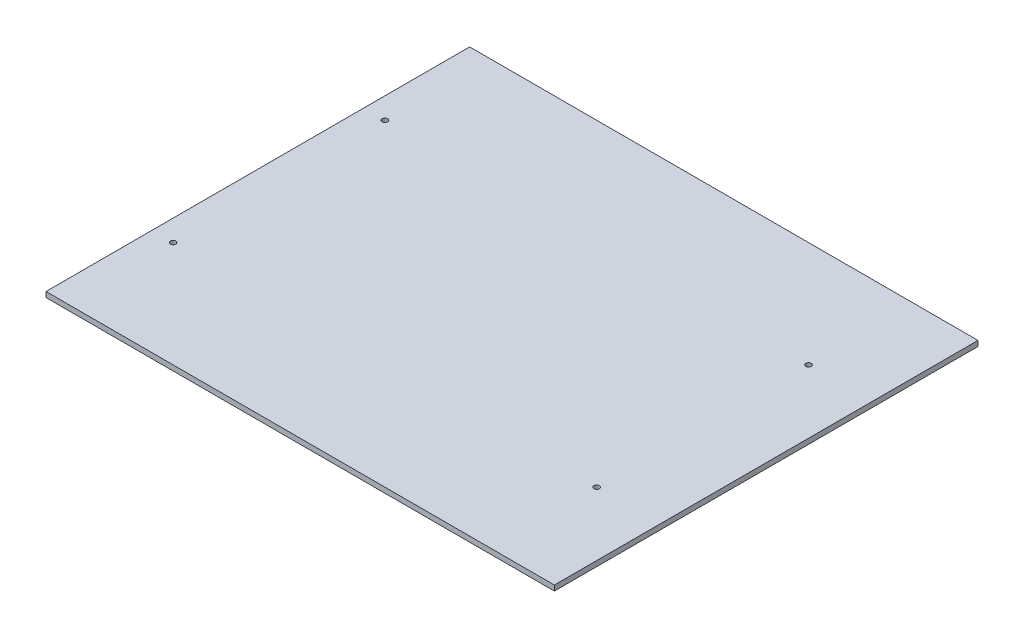
ISO-10303-21;
HEADER;
FILE_DESCRIPTION(('STEP AP214'),'2;1');
FILE_NAME('part.step','',(''),(''),'','','');
FILE_SCHEMA(('AUTOMOTIVE_DESIGN { 1 0 10303 214 1 1 1 1 }'));
ENDSEC;
DATA;
#1=APPLICATION_CONTEXT('core data for automotive mechanical design processes');
#2=APPLICATION_PROTOCOL_DEFINITION('international standard','automotive_design',2000,#1);
#3=PRODUCT_CONTEXT('',#1,'mechanical');
#4=PRODUCT('Part','Part','',(#3));
#5=PRODUCT_RELATED_PRODUCT_CATEGORY('part','',(#4));
#6=PRODUCT_DEFINITION_FORMATION('','',#4);
#7=PRODUCT_DEFINITION_CONTEXT('part definition',#1,'design');
#8=PRODUCT_DEFINITION('design','',#6,#7);
#9=PRODUCT_DEFINITION_SHAPE('','',#8);
#10=(LENGTH_UNIT() NAMED_UNIT(*) SI_UNIT(.MILLI.,.METRE.));
#11=(NAMED_UNIT(*) PLANE_ANGLE_UNIT() SI_UNIT($,.RADIAN.));
#12=(NAMED_UNIT(*) SI_UNIT($,.STERADIAN.) SOLID_ANGLE_UNIT());
#13=UNCERTAINTY_MEASURE_WITH_UNIT(LENGTH_MEASURE(1.E-05),#10,'distance_accuracy_value','');
#14=(GEOMETRIC_REPRESENTATION_CONTEXT(3) GLOBAL_UNCERTAINTY_ASSIGNED_CONTEXT((#13)) GLOBAL_UNIT_ASSIGNED_CONTEXT((#10,
#11,#12)) REPRESENTATION_CONTEXT('',''));
#15=CARTESIAN_POINT('',(0.,0.,0.));
#16=DIRECTION('',(0.,0.,1.));
#17=DIRECTION('',(1.,0.,0.));
#18=AXIS2_PLACEMENT_3D('',#15,#16,#17);
#19=CARTESIAN_POINT('',(0.,6.35,0.));
#20=DIRECTION('',(-1.,0.,0.));
#21=DIRECTION('',(0.,0.,1.));
#22=AXIS2_PLACEMENT_3D('',#19,#20,#21);
#23=PLANE('',#22);
#24=DIRECTION('',(0.,0.,-1.));
#25=VECTOR('',#24,1.);
#26=CARTESIAN_POINT('',(0.,0.,0.));
#27=LINE('',#26,#25);
#28=CARTESIAN_POINT('',(0.,0.,0.));
#29=VERTEX_POINT('',#28);
#30=CARTESIAN_POINT('',(0.,0.,-508.));
#31=VERTEX_POINT('',#30);
#32=EDGE_CURVE('E114',#29,#31,#27,.T.);
#33=ORIENTED_EDGE('',*,*,#32,.T.);
#34=DIRECTION('',(0.,-1.,0.));
#35=VECTOR('',#34,1.);
#36=CARTESIAN_POINT('',(0.,6.35,-508.));
#37=LINE('',#36,#35);
#38=CARTESIAN_POINT('',(0.,6.35,-508.));
#39=VERTEX_POINT('',#38);
#40=EDGE_CURVE('E11',#39,#31,#37,.T.);
#41=ORIENTED_EDGE('',*,*,#40,.F.);
#42=DIRECTION('',(0.,0.,-1.));
#43=VECTOR('',#42,1.);
#44=CARTESIAN_POINT('',(0.,6.35,0.));
#45=LINE('',#44,#43);
#46=CARTESIAN_POINT('',(0.,6.35,0.));
#47=VERTEX_POINT('',#46);
#48=EDGE_CURVE('E97',#47,#39,#45,.T.);
#49=ORIENTED_EDGE('',*,*,#48,.F.);
#50=DIRECTION('',(0.,-1.,0.));
#51=VECTOR('',#50,1.);
#52=CARTESIAN_POINT('',(0.,6.35,0.));
#53=LINE('',#52,#51);
#54=EDGE_CURVE('E110',#47,#29,#53,.T.);
#55=ORIENTED_EDGE('',*,*,#54,.T.);
#56=EDGE_LOOP('',(#33,#41,#49,#55));
#57=FACE_BOUND('',#56,.T.);
#58=ADVANCED_FACE('F43',(#57),#23,.F.);
#59=CARTESIAN_POINT('',(0.,6.35,-508.));
#60=DIRECTION('',(0.,0.,1.));
#61=DIRECTION('',(1.,0.,0.));
#62=AXIS2_PLACEMENT_3D('',#59,#60,#61);
#63=PLANE('',#62);
#64=DIRECTION('',(-1.,0.,0.));
#65=VECTOR('',#64,1.);
#66=CARTESIAN_POINT('',(0.,0.,-508.));
#67=LINE('',#66,#65);
#68=CARTESIAN_POINT('',(-609.6,0.,-508.));
#69=VERTEX_POINT('',#68);
#70=EDGE_CURVE('E102',#31,#69,#67,.T.);
#71=ORIENTED_EDGE('',*,*,#70,.T.);
#72=DIRECTION('',(0.,-1.,0.));
#73=VECTOR('',#72,1.);
#74=CARTESIAN_POINT('',(-609.6,6.35,-508.));
#75=LINE('',#74,#73);
#76=CARTESIAN_POINT('',(-609.6,6.35,-508.));
#77=VERTEX_POINT('',#76);
#78=EDGE_CURVE('E53',#77,#69,#75,.T.);
#79=ORIENTED_EDGE('',*,*,#78,.F.);
#80=DIRECTION('',(-1.,0.,0.));
#81=VECTOR('',#80,1.);
#82=CARTESIAN_POINT('',(0.,6.35,-508.));
#83=LINE('',#82,#81);
#84=EDGE_CURVE('E92',#39,#77,#83,.T.);
#85=ORIENTED_EDGE('',*,*,#84,.F.);
#86=ORIENTED_EDGE('',*,*,#40,.T.);
#87=EDGE_LOOP('',(#71,#79,#85,#86));
#88=FACE_BOUND('',#87,.T.);
#89=ADVANCED_FACE('F101',(#88),#63,.F.);
#90=CARTESIAN_POINT('',(-609.6,6.35,0.));
#91=DIRECTION('',(1.,0.,0.));
#92=DIRECTION('',(0.,0.,-1.));
#93=AXIS2_PLACEMENT_3D('',#90,#91,#92);
#94=PLANE('',#93);
#95=DIRECTION('',(0.,0.,1.));
#96=VECTOR('',#95,1.);
#97=CARTESIAN_POINT('',(-609.6,0.,0.));
#98=LINE('',#97,#96);
#99=CARTESIAN_POINT('',(-609.6,0.,0.));
#100=VERTEX_POINT('',#99);
#101=EDGE_CURVE('E79',#69,#100,#98,.T.);
#102=ORIENTED_EDGE('',*,*,#101,.T.);
#103=DIRECTION('',(0.,-1.,0.));
#104=VECTOR('',#103,1.);
#105=CARTESIAN_POINT('',(-609.6,6.35,0.));
#106=LINE('',#105,#104);
#107=CARTESIAN_POINT('',(-609.6,6.35,0.));
#108=VERTEX_POINT('',#107);
#109=EDGE_CURVE('E104',#108,#100,#106,.T.);
#110=ORIENTED_EDGE('',*,*,#109,.F.);
#111=DIRECTION('',(0.,0.,1.));
#112=VECTOR('',#111,1.);
#113=CARTESIAN_POINT('',(-609.6,6.35,0.));
#114=LINE('',#113,#112);
#115=EDGE_CURVE('E95',#77,#108,#114,.T.);
#116=ORIENTED_EDGE('',*,*,#115,.F.);
#117=ORIENTED_EDGE('',*,*,#78,.T.);
#118=EDGE_LOOP('',(#102,#110,#116,#117));
#119=FACE_BOUND('',#118,.T.);
#120=ADVANCED_FACE('F106',(#119),#94,.F.);
#121=CARTESIAN_POINT('',(0.,6.35,0.));
#122=DIRECTION('',(0.,0.,-1.));
#123=DIRECTION('',(-1.,0.,0.));
#124=AXIS2_PLACEMENT_3D('',#121,#122,#123);
#125=PLANE('',#124);
#126=DIRECTION('',(1.,0.,0.));
#127=VECTOR('',#126,1.);
#128=CARTESIAN_POINT('',(0.,0.,0.));
#129=LINE('',#128,#127);
#130=EDGE_CURVE('E85',#100,#29,#129,.T.);
#131=ORIENTED_EDGE('',*,*,#130,.T.);
#132=ORIENTED_EDGE('',*,*,#54,.F.);
#133=DIRECTION('',(1.,0.,0.));
#134=VECTOR('',#133,1.);
#135=CARTESIAN_POINT('',(0.,6.35,0.));
#136=LINE('',#135,#134);
#137=EDGE_CURVE('E62',#108,#47,#136,.T.);
#138=ORIENTED_EDGE('',*,*,#137,.F.);
#139=ORIENTED_EDGE('',*,*,#109,.T.);
#140=EDGE_LOOP('',(#131,#132,#138,#139));
#141=FACE_BOUND('',#140,.T.);
#142=ADVANCED_FACE('F186',(#141),#125,.F.);
#143=CARTESIAN_POINT('',(0.,6.35,0.));
#144=DIRECTION('',(0.,1.,0.));
#145=DIRECTION('',(0.,0.,1.));
#146=AXIS2_PLACEMENT_3D('',#143,#144,#145);
#147=PLANE('',#146);
#148=CARTESIAN_POINT('',(-76.2,6.35,-381.));
#149=DIRECTION('',(0.,1.,0.));
#150=DIRECTION('',(0.,0.,1.));
#151=AXIS2_PLACEMENT_3D('',#148,#149,#150);
#152=CIRCLE('',#151,3.26389999999999);
#153=CARTESIAN_POINT('',(-76.2,6.35,-377.7361));
#154=VERTEX_POINT('',#153);
#155=EDGE_CURVE('E146',#154,#154,#152,.T.);
#156=ORIENTED_EDGE('',*,*,#155,.F.);
#157=EDGE_LOOP('',(#156));
#158=FACE_BOUND('',#157,.T.);
#159=CARTESIAN_POINT('',(-76.2,6.35,-127.));
#160=DIRECTION('',(0.,1.,0.));
#161=DIRECTION('',(0.,0.,1.));
#162=AXIS2_PLACEMENT_3D('',#159,#160,#161);
#163=CIRCLE('',#162,3.26389999999999);
#164=CARTESIAN_POINT('',(-76.2,6.35,-123.7361));
#165=VERTEX_POINT('',#164);
#166=EDGE_CURVE('E132',#165,#165,#163,.T.);
#167=ORIENTED_EDGE('',*,*,#166,.F.);
#168=EDGE_LOOP('',(#167));
#169=FACE_BOUND('',#168,.T.);
#170=CARTESIAN_POINT('',(-584.2,6.35,-127.));
#171=DIRECTION('',(0.,1.,0.));
#172=DIRECTION('',(0.,0.,1.));
#173=AXIS2_PLACEMENT_3D('',#170,#171,#172);
#174=CIRCLE('',#173,3.26389999999999);
#175=CARTESIAN_POINT('',(-584.2,6.35,-123.7361));
#176=VERTEX_POINT('',#175);
#177=EDGE_CURVE('E131',#176,#176,#174,.T.);
#178=ORIENTED_EDGE('',*,*,#177,.F.);
#179=EDGE_LOOP('',(#178));
#180=FACE_BOUND('',#179,.T.);
#181=CARTESIAN_POINT('',(-584.2,6.35,-381.));
#182=DIRECTION('',(0.,1.,0.));
#183=DIRECTION('',(0.,0.,1.));
#184=AXIS2_PLACEMENT_3D('',#181,#182,#183);
#185=CIRCLE('',#184,3.26389999999999);
#186=CARTESIAN_POINT('',(-584.2,6.35,-377.7361));
#187=VERTEX_POINT('',#186);
#188=EDGE_CURVE('E152',#187,#187,#185,.T.);
#189=ORIENTED_EDGE('',*,*,#188,.F.);
#190=EDGE_LOOP('',(#189));
#191=FACE_BOUND('',#190,.T.);
#192=ORIENTED_EDGE('',*,*,#48,.T.);
#193=ORIENTED_EDGE('',*,*,#84,.T.);
#194=ORIENTED_EDGE('',*,*,#115,.T.);
#195=ORIENTED_EDGE('',*,*,#137,.T.);
#196=EDGE_LOOP('',(#192,#193,#194,#195));
#197=FACE_BOUND('',#196,.T.);
#198=ADVANCED_FACE('F93',(#158,#169,#180,#191,#197),#147,.T.);
#199=CARTESIAN_POINT('',(0.,0.,0.));
#200=DIRECTION('',(0.,1.,0.));
#201=DIRECTION('',(0.,0.,1.));
#202=AXIS2_PLACEMENT_3D('',#199,#200,#201);
#203=PLANE('',#202);
#204=CARTESIAN_POINT('',(-76.2,0.,-381.));
#205=DIRECTION('',(0.,1.,0.));
#206=DIRECTION('',(0.,0.,1.));
#207=AXIS2_PLACEMENT_3D('',#204,#205,#206);
#208=CIRCLE('',#207,3.26389999999999);
#209=CARTESIAN_POINT('',(-76.2,0.,-377.7361));
#210=VERTEX_POINT('',#209);
#211=EDGE_CURVE('E46',#210,#210,#208,.T.);
#212=ORIENTED_EDGE('',*,*,#211,.T.);
#213=EDGE_LOOP('',(#212));
#214=FACE_BOUND('',#213,.T.);
#215=CARTESIAN_POINT('',(-76.2,0.,-127.));
#216=DIRECTION('',(0.,1.,0.));
#217=DIRECTION('',(0.,0.,1.));
#218=AXIS2_PLACEMENT_3D('',#215,#216,#217);
#219=CIRCLE('',#218,3.26389999999999);
#220=CARTESIAN_POINT('',(-76.2,0.,-123.7361));
#221=VERTEX_POINT('',#220);
#222=EDGE_CURVE('E128',#221,#221,#219,.T.);
#223=ORIENTED_EDGE('',*,*,#222,.T.);
#224=EDGE_LOOP('',(#223));
#225=FACE_BOUND('',#224,.T.);
#226=CARTESIAN_POINT('',(-584.2,0.,-127.));
#227=DIRECTION('',(0.,1.,0.));
#228=DIRECTION('',(0.,0.,1.));
#229=AXIS2_PLACEMENT_3D('',#226,#227,#228);
#230=CIRCLE('',#229,3.26389999999999);
#231=CARTESIAN_POINT('',(-584.2,0.,-123.7361));
#232=VERTEX_POINT('',#231);
#233=EDGE_CURVE('E138',#232,#232,#230,.T.);
#234=ORIENTED_EDGE('',*,*,#233,.T.);
#235=EDGE_LOOP('',(#234));
#236=FACE_BOUND('',#235,.T.);
#237=CARTESIAN_POINT('',(-584.2,0.,-381.));
#238=DIRECTION('',(0.,1.,0.));
#239=DIRECTION('',(0.,0.,1.));
#240=AXIS2_PLACEMENT_3D('',#237,#238,#239);
#241=CIRCLE('',#240,3.26389999999999);
#242=CARTESIAN_POINT('',(-584.2,0.,-377.7361));
#243=VERTEX_POINT('',#242);
#244=EDGE_CURVE('E118',#243,#243,#241,.T.);
#245=ORIENTED_EDGE('',*,*,#244,.T.);
#246=EDGE_LOOP('',(#245));
#247=FACE_BOUND('',#246,.T.);
#248=ORIENTED_EDGE('',*,*,#32,.F.);
#249=ORIENTED_EDGE('',*,*,#130,.F.);
#250=ORIENTED_EDGE('',*,*,#101,.F.);
#251=ORIENTED_EDGE('',*,*,#70,.F.);
#252=EDGE_LOOP('',(#248,#249,#250,#251));
#253=FACE_BOUND('',#252,.T.);
#254=ADVANCED_FACE('F161',(#214,#225,#236,#247,#253),#203,.F.);
#255=CARTESIAN_POINT('',(-584.2,6.35,-381.));
#256=DIRECTION('',(0.,1.,0.));
#257=DIRECTION('',(0.,0.,1.));
#258=AXIS2_PLACEMENT_3D('',#255,#256,#257);
#259=CYLINDRICAL_SURFACE('',#258,3.26389999999999);
#260=ORIENTED_EDGE('',*,*,#188,.T.);
#261=EDGE_LOOP('',(#260));
#262=FACE_BOUND('',#261,.T.);
#263=ORIENTED_EDGE('',*,*,#244,.F.);
#264=EDGE_LOOP('',(#263));
#265=FACE_BOUND('',#264,.T.);
#266=ADVANCED_FACE('F164',(#262,#265),#259,.F.);
#267=CARTESIAN_POINT('',(-584.2,6.35,-127.));
#268=DIRECTION('',(0.,1.,0.));
#269=DIRECTION('',(0.,0.,1.));
#270=AXIS2_PLACEMENT_3D('',#267,#268,#269);
#271=CYLINDRICAL_SURFACE('',#270,3.26389999999999);
#272=ORIENTED_EDGE('',*,*,#177,.T.);
#273=EDGE_LOOP('',(#272));
#274=FACE_BOUND('',#273,.T.);
#275=ORIENTED_EDGE('',*,*,#233,.F.);
#276=EDGE_LOOP('',(#275));
#277=FACE_BOUND('',#276,.T.);
#278=ADVANCED_FACE('F166',(#274,#277),#271,.F.);
#279=CARTESIAN_POINT('',(-76.2,6.35,-127.));
#280=DIRECTION('',(0.,1.,0.));
#281=DIRECTION('',(0.,0.,1.));
#282=AXIS2_PLACEMENT_3D('',#279,#280,#281);
#283=CYLINDRICAL_SURFACE('',#282,3.26389999999999);
#284=ORIENTED_EDGE('',*,*,#166,.T.);
#285=EDGE_LOOP('',(#284));
#286=FACE_BOUND('',#285,.T.);
#287=ORIENTED_EDGE('',*,*,#222,.F.);
#288=EDGE_LOOP('',(#287));
#289=FACE_BOUND('',#288,.T.);
#290=ADVANCED_FACE('F173',(#286,#289),#283,.F.);
#291=CARTESIAN_POINT('',(-76.2,6.35,-381.));
#292=DIRECTION('',(0.,1.,0.));
#293=DIRECTION('',(0.,0.,1.));
#294=AXIS2_PLACEMENT_3D('',#291,#292,#293);
#295=CYLINDRICAL_SURFACE('',#294,3.26389999999999);
#296=ORIENTED_EDGE('',*,*,#155,.T.);
#297=EDGE_LOOP('',(#296));
#298=FACE_BOUND('',#297,.T.);
#299=ORIENTED_EDGE('',*,*,#211,.F.);
#300=EDGE_LOOP('',(#299));
#301=FACE_BOUND('',#300,.T.);
#302=ADVANCED_FACE('F239',(#298,#301),#295,.F.);
#303=CLOSED_SHELL('',(#58,#89,#120,#142,#198,#254,#266,#278,#290,#302));
#304=MANIFOLD_SOLID_BREP('B2',#303);
#305=ADVANCED_BREP_SHAPE_REPRESENTATION('',(#18,#304),#14);
#306=SHAPE_DEFINITION_REPRESENTATION(#9,#305);
ENDSEC;
END-ISO-10303-21;
